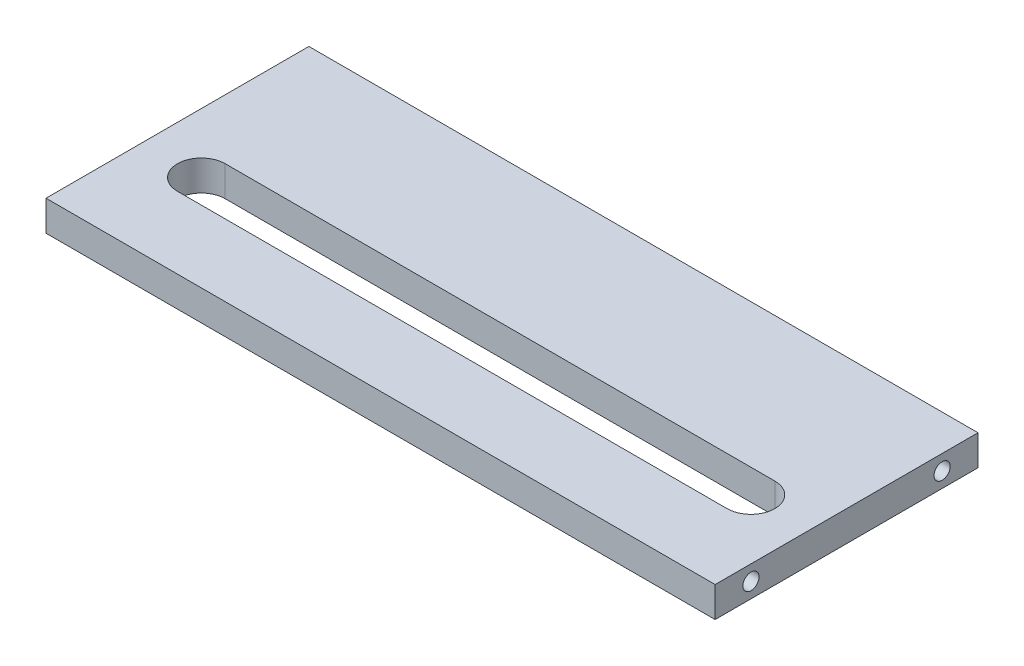
ISO-10303-21;
HEADER;
FILE_DESCRIPTION(('STEP AP214'),'2;1');
FILE_NAME('part.step','',(''),(''),'','','');
FILE_SCHEMA(('AUTOMOTIVE_DESIGN { 1 0 10303 214 1 1 1 1 }'));
ENDSEC;
DATA;
#1=APPLICATION_CONTEXT('core data for automotive mechanical design processes');
#2=APPLICATION_PROTOCOL_DEFINITION('international standard','automotive_design',2000,#1);
#3=PRODUCT_CONTEXT('',#1,'mechanical');
#4=PRODUCT('Part','Part','',(#3));
#5=PRODUCT_RELATED_PRODUCT_CATEGORY('part','',(#4));
#6=PRODUCT_DEFINITION_FORMATION('','',#4);
#7=PRODUCT_DEFINITION_CONTEXT('part definition',#1,'design');
#8=PRODUCT_DEFINITION('design','',#6,#7);
#9=PRODUCT_DEFINITION_SHAPE('','',#8);
#10=(LENGTH_UNIT() NAMED_UNIT(*) SI_UNIT(.MILLI.,.METRE.));
#11=(NAMED_UNIT(*) PLANE_ANGLE_UNIT() SI_UNIT($,.RADIAN.));
#12=(NAMED_UNIT(*) SI_UNIT($,.STERADIAN.) SOLID_ANGLE_UNIT());
#13=UNCERTAINTY_MEASURE_WITH_UNIT(LENGTH_MEASURE(1.E-05),#10,'distance_accuracy_value','');
#14=(GEOMETRIC_REPRESENTATION_CONTEXT(3) GLOBAL_UNCERTAINTY_ASSIGNED_CONTEXT((#13)) GLOBAL_UNIT_ASSIGNED_CONTEXT((#10,
#11,#12)) REPRESENTATION_CONTEXT('',''));
#15=CARTESIAN_POINT('',(0.,0.,0.));
#16=DIRECTION('',(0.,0.,1.));
#17=DIRECTION('',(1.,0.,0.));
#18=AXIS2_PLACEMENT_3D('',#15,#16,#17);
#19=CARTESIAN_POINT('',(0.,12.7,0.));
#20=DIRECTION('',(0.,1.,0.));
#21=DIRECTION('',(0.,0.,1.));
#22=AXIS2_PLACEMENT_3D('',#19,#20,#21);
#23=PLANE('',#22);
#24=DIRECTION('',(0.,0.,1.));
#25=VECTOR('',#24,1.);
#26=CARTESIAN_POINT('',(-125.705705705706,12.7,-56.7567567567568));
#27=LINE('',#26,#25);
#28=CARTESIAN_POINT('',(-125.705705705706,12.7,-56.7567567567568));
#29=VERTEX_POINT('',#28);
#30=CARTESIAN_POINT('',(-125.705705705706,12.7,53.2432432432432));
#31=VERTEX_POINT('',#30);
#32=EDGE_CURVE('E141',#29,#31,#27,.T.);
#33=ORIENTED_EDGE('',*,*,#32,.T.);
#34=DIRECTION('',(1.,0.,0.));
#35=VECTOR('',#34,1.);
#36=CARTESIAN_POINT('',(-125.705705705706,12.7,53.2432432432432));
#37=LINE('',#36,#35);
#38=CARTESIAN_POINT('',(154.294294294294,12.7,53.2432432432432));
#39=VERTEX_POINT('',#38);
#40=EDGE_CURVE('E144',#31,#39,#37,.T.);
#41=ORIENTED_EDGE('',*,*,#40,.T.);
#42=DIRECTION('',(0.,0.,-1.));
#43=VECTOR('',#42,1.);
#44=CARTESIAN_POINT('',(154.294294294294,12.7,-56.7567567567568));
#45=LINE('',#44,#43);
#46=CARTESIAN_POINT('',(154.294294294294,12.7,-56.7567567567568));
#47=VERTEX_POINT('',#46);
#48=EDGE_CURVE('E147',#39,#47,#45,.T.);
#49=ORIENTED_EDGE('',*,*,#48,.T.);
#50=DIRECTION('',(-1.,0.,0.));
#51=VECTOR('',#50,1.);
#52=CARTESIAN_POINT('',(-125.705705705706,12.7,-56.7567567567568));
#53=LINE('',#52,#51);
#54=EDGE_CURVE('E149',#47,#29,#53,.T.);
#55=ORIENTED_EDGE('',*,*,#54,.T.);
#56=EDGE_LOOP('',(#33,#41,#49,#55));
#57=FACE_BOUND('',#56,.T.);
#58=DIRECTION('',(-1.,0.,0.));
#59=VECTOR('',#58,1.);
#60=CARTESIAN_POINT('',(0.,12.7,23.2432432432432));
#61=LINE('',#60,#59);
#62=CARTESIAN_POINT('',(129.294294294294,12.7,23.2432432432432));
#63=VERTEX_POINT('',#62);
#64=CARTESIAN_POINT('',(-100.705705705706,12.7,23.2432432432432));
#65=VERTEX_POINT('',#64);
#66=EDGE_CURVE('E137',#63,#65,#61,.T.);
#67=ORIENTED_EDGE('',*,*,#66,.T.);
#68=CARTESIAN_POINT('',(-100.705705705706,12.7,13.2432432432432));
#69=DIRECTION('',(0.,1.,0.));
#70=DIRECTION('',(0.,0.,1.));
#71=AXIS2_PLACEMENT_3D('',#68,#69,#70);
#72=CIRCLE('',#71,10.);
#73=CARTESIAN_POINT('',(-100.705705705706,12.7,3.24324324324324));
#74=VERTEX_POINT('',#73);
#75=EDGE_CURVE('E101',#65,#74,#72,.F.);
#76=ORIENTED_EDGE('',*,*,#75,.T.);
#77=DIRECTION('',(1.,0.,0.));
#78=VECTOR('',#77,1.);
#79=CARTESIAN_POINT('',(0.,12.7,3.24324324324324));
#80=LINE('',#79,#78);
#81=CARTESIAN_POINT('',(129.294294294294,12.7,3.24324324324324));
#82=VERTEX_POINT('',#81);
#83=EDGE_CURVE('E104',#74,#82,#80,.T.);
#84=ORIENTED_EDGE('',*,*,#83,.T.);
#85=CARTESIAN_POINT('',(129.294294294294,12.7,13.2432432432432));
#86=DIRECTION('',(0.,1.,0.));
#87=DIRECTION('',(0.,0.,1.));
#88=AXIS2_PLACEMENT_3D('',#85,#86,#87);
#89=CIRCLE('',#88,10.);
#90=EDGE_CURVE('E134',#82,#63,#89,.F.);
#91=ORIENTED_EDGE('',*,*,#90,.T.);
#92=EDGE_LOOP('',(#67,#76,#84,#91));
#93=FACE_BOUND('',#92,.T.);
#94=ADVANCED_FACE('F33',(#57,#93),#23,.T.);
#95=CARTESIAN_POINT('',(0.,0.,0.));
#96=DIRECTION('',(0.,1.,0.));
#97=DIRECTION('',(0.,0.,1.));
#98=AXIS2_PLACEMENT_3D('',#95,#96,#97);
#99=PLANE('',#98);
#100=DIRECTION('',(0.,0.,1.));
#101=VECTOR('',#100,1.);
#102=CARTESIAN_POINT('',(-125.705705705706,0.,-56.7567567567568));
#103=LINE('',#102,#101);
#104=CARTESIAN_POINT('',(-125.705705705706,0.,-56.7567567567568));
#105=VERTEX_POINT('',#104);
#106=CARTESIAN_POINT('',(-125.705705705706,0.,53.2432432432432));
#107=VERTEX_POINT('',#106);
#108=EDGE_CURVE('E140',#105,#107,#103,.T.);
#109=ORIENTED_EDGE('',*,*,#108,.F.);
#110=DIRECTION('',(-1.,0.,0.));
#111=VECTOR('',#110,1.);
#112=CARTESIAN_POINT('',(-125.705705705706,0.,-56.7567567567568));
#113=LINE('',#112,#111);
#114=CARTESIAN_POINT('',(154.294294294294,0.,-56.7567567567568));
#115=VERTEX_POINT('',#114);
#116=EDGE_CURVE('E145',#115,#105,#113,.T.);
#117=ORIENTED_EDGE('',*,*,#116,.F.);
#118=DIRECTION('',(0.,0.,-1.));
#119=VECTOR('',#118,1.);
#120=CARTESIAN_POINT('',(154.294294294294,0.,-56.7567567567568));
#121=LINE('',#120,#119);
#122=CARTESIAN_POINT('',(154.294294294294,0.,53.2432432432432));
#123=VERTEX_POINT('',#122);
#124=EDGE_CURVE('E156',#123,#115,#121,.T.);
#125=ORIENTED_EDGE('',*,*,#124,.F.);
#126=DIRECTION('',(1.,0.,0.));
#127=VECTOR('',#126,1.);
#128=CARTESIAN_POINT('',(-125.705705705706,0.,53.2432432432432));
#129=LINE('',#128,#127);
#130=EDGE_CURVE('E154',#107,#123,#129,.T.);
#131=ORIENTED_EDGE('',*,*,#130,.F.);
#132=EDGE_LOOP('',(#109,#117,#125,#131));
#133=FACE_BOUND('',#132,.T.);
#134=CARTESIAN_POINT('',(-100.705705705706,0.,13.2432432432432));
#135=DIRECTION('',(0.,1.,0.));
#136=DIRECTION('',(0.,0.,1.));
#137=AXIS2_PLACEMENT_3D('',#134,#135,#136);
#138=CIRCLE('',#137,10.);
#139=CARTESIAN_POINT('',(-100.705705705706,0.,3.24324324324324));
#140=VERTEX_POINT('',#139);
#141=CARTESIAN_POINT('',(-100.705705705706,0.,23.2432432432432));
#142=VERTEX_POINT('',#141);
#143=EDGE_CURVE('E56',#140,#142,#138,.T.);
#144=ORIENTED_EDGE('',*,*,#143,.T.);
#145=DIRECTION('',(1.,0.,0.));
#146=VECTOR('',#145,1.);
#147=CARTESIAN_POINT('',(-100.705705705706,0.,23.2432432432432));
#148=LINE('',#147,#146);
#149=CARTESIAN_POINT('',(129.294294294294,0.,23.2432432432432));
#150=VERTEX_POINT('',#149);
#151=EDGE_CURVE('E108',#142,#150,#148,.T.);
#152=ORIENTED_EDGE('',*,*,#151,.T.);
#153=CARTESIAN_POINT('',(129.294294294294,0.,13.2432432432432));
#154=DIRECTION('',(0.,1.,0.));
#155=DIRECTION('',(0.,0.,1.));
#156=AXIS2_PLACEMENT_3D('',#153,#154,#155);
#157=CIRCLE('',#156,10.);
#158=CARTESIAN_POINT('',(129.294294294294,0.,3.24324324324324));
#159=VERTEX_POINT('',#158);
#160=EDGE_CURVE('E114',#150,#159,#157,.T.);
#161=ORIENTED_EDGE('',*,*,#160,.T.);
#162=DIRECTION('',(-1.,0.,0.));
#163=VECTOR('',#162,1.);
#164=CARTESIAN_POINT('',(-100.705705705706,0.,3.24324324324324));
#165=LINE('',#164,#163);
#166=EDGE_CURVE('E118',#159,#140,#165,.T.);
#167=ORIENTED_EDGE('',*,*,#166,.T.);
#168=EDGE_LOOP('',(#144,#152,#161,#167));
#169=FACE_BOUND('',#168,.T.);
#170=ADVANCED_FACE('F117',(#133,#169),#99,.F.);
#171=CARTESIAN_POINT('',(-125.705705705706,12.7,-56.7567567567568));
#172=DIRECTION('',(1.,0.,0.));
#173=DIRECTION('',(0.,0.,-1.));
#174=AXIS2_PLACEMENT_3D('',#171,#172,#173);
#175=PLANE('',#174);
#176=CARTESIAN_POINT('',(-125.705705705706,6.35,-41.7567567567568));
#177=DIRECTION('',(-1.,0.,0.));
#178=DIRECTION('',(0.,0.,1.));
#179=AXIS2_PLACEMENT_3D('',#176,#177,#178);
#180=CIRCLE('',#179,3.375);
#181=CARTESIAN_POINT('',(-125.705705705706,6.35,-38.3817567567568));
#182=VERTEX_POINT('',#181);
#183=EDGE_CURVE('E264',#182,#182,#180,.T.);
#184=ORIENTED_EDGE('',*,*,#183,.F.);
#185=EDGE_LOOP('',(#184));
#186=FACE_BOUND('',#185,.T.);
#187=CARTESIAN_POINT('',(-125.705705705706,6.35,38.2432432432432));
#188=DIRECTION('',(-1.,0.,0.));
#189=DIRECTION('',(0.,0.,1.));
#190=AXIS2_PLACEMENT_3D('',#187,#188,#189);
#191=CIRCLE('',#190,3.375);
#192=CARTESIAN_POINT('',(-125.705705705706,6.35,41.6182432432432));
#193=VERTEX_POINT('',#192);
#194=EDGE_CURVE('E122',#193,#193,#191,.T.);
#195=ORIENTED_EDGE('',*,*,#194,.F.);
#196=EDGE_LOOP('',(#195));
#197=FACE_BOUND('',#196,.T.);
#198=ORIENTED_EDGE('',*,*,#108,.T.);
#199=DIRECTION('',(0.,-1.,0.));
#200=VECTOR('',#199,1.);
#201=CARTESIAN_POINT('',(-125.705705705706,12.7,53.2432432432432));
#202=LINE('',#201,#200);
#203=EDGE_CURVE('E11',#31,#107,#202,.T.);
#204=ORIENTED_EDGE('',*,*,#203,.F.);
#205=ORIENTED_EDGE('',*,*,#32,.F.);
#206=DIRECTION('',(0.,-1.,0.));
#207=VECTOR('',#206,1.);
#208=CARTESIAN_POINT('',(-125.705705705706,12.7,-56.7567567567568));
#209=LINE('',#208,#207);
#210=EDGE_CURVE('E151',#29,#105,#209,.T.);
#211=ORIENTED_EDGE('',*,*,#210,.T.);
#212=EDGE_LOOP('',(#198,#204,#205,#211));
#213=FACE_BOUND('',#212,.T.);
#214=ADVANCED_FACE('F35',(#186,#197,#213),#175,.F.);
#215=CARTESIAN_POINT('',(-125.705705705706,12.7,53.2432432432432));
#216=DIRECTION('',(0.,0.,-1.));
#217=DIRECTION('',(-1.,0.,0.));
#218=AXIS2_PLACEMENT_3D('',#215,#216,#217);
#219=PLANE('',#218);
#220=ORIENTED_EDGE('',*,*,#130,.T.);
#221=DIRECTION('',(0.,-1.,0.));
#222=VECTOR('',#221,1.);
#223=CARTESIAN_POINT('',(154.294294294294,12.7,53.2432432432432));
#224=LINE('',#223,#222);
#225=EDGE_CURVE('E41',#39,#123,#224,.T.);
#226=ORIENTED_EDGE('',*,*,#225,.F.);
#227=ORIENTED_EDGE('',*,*,#40,.F.);
#228=ORIENTED_EDGE('',*,*,#203,.T.);
#229=EDGE_LOOP('',(#220,#226,#227,#228));
#230=FACE_BOUND('',#229,.T.);
#231=ADVANCED_FACE('F183',(#230),#219,.F.);
#232=CARTESIAN_POINT('',(154.294294294294,12.7,-56.7567567567568));
#233=DIRECTION('',(-1.,0.,0.));
#234=DIRECTION('',(0.,0.,1.));
#235=AXIS2_PLACEMENT_3D('',#232,#233,#234);
#236=PLANE('',#235);
#237=CARTESIAN_POINT('',(154.294294294294,6.35,38.2432432432432));
#238=DIRECTION('',(1.,0.,0.));
#239=DIRECTION('',(0.,0.,-1.));
#240=AXIS2_PLACEMENT_3D('',#237,#238,#239);
#241=CIRCLE('',#240,3.375);
#242=CARTESIAN_POINT('',(154.294294294294,6.35,34.8682432432432));
#243=VERTEX_POINT('',#242);
#244=EDGE_CURVE('E255',#243,#243,#241,.T.);
#245=ORIENTED_EDGE('',*,*,#244,.F.);
#246=EDGE_LOOP('',(#245));
#247=FACE_BOUND('',#246,.T.);
#248=CARTESIAN_POINT('',(154.294294294294,6.35,-41.7567567567568));
#249=DIRECTION('',(1.,0.,0.));
#250=DIRECTION('',(0.,0.,-1.));
#251=AXIS2_PLACEMENT_3D('',#248,#249,#250);
#252=CIRCLE('',#251,3.375);
#253=CARTESIAN_POINT('',(154.294294294294,6.35,-45.1317567567568));
#254=VERTEX_POINT('',#253);
#255=EDGE_CURVE('E254',#254,#254,#252,.T.);
#256=ORIENTED_EDGE('',*,*,#255,.F.);
#257=EDGE_LOOP('',(#256));
#258=FACE_BOUND('',#257,.T.);
#259=ORIENTED_EDGE('',*,*,#124,.T.);
#260=DIRECTION('',(0.,-1.,0.));
#261=VECTOR('',#260,1.);
#262=CARTESIAN_POINT('',(154.294294294294,12.7,-56.7567567567568));
#263=LINE('',#262,#261);
#264=EDGE_CURVE('E161',#47,#115,#263,.T.);
#265=ORIENTED_EDGE('',*,*,#264,.F.);
#266=ORIENTED_EDGE('',*,*,#48,.F.);
#267=ORIENTED_EDGE('',*,*,#225,.T.);
#268=EDGE_LOOP('',(#259,#265,#266,#267));
#269=FACE_BOUND('',#268,.T.);
#270=ADVANCED_FACE('F168',(#247,#258,#269),#236,.F.);
#271=CARTESIAN_POINT('',(-125.705705705706,12.7,-56.7567567567568));
#272=DIRECTION('',(0.,0.,1.));
#273=DIRECTION('',(1.,0.,0.));
#274=AXIS2_PLACEMENT_3D('',#271,#272,#273);
#275=PLANE('',#274);
#276=ORIENTED_EDGE('',*,*,#116,.T.);
#277=ORIENTED_EDGE('',*,*,#210,.F.);
#278=ORIENTED_EDGE('',*,*,#54,.F.);
#279=ORIENTED_EDGE('',*,*,#264,.T.);
#280=EDGE_LOOP('',(#276,#277,#278,#279));
#281=FACE_BOUND('',#280,.T.);
#282=ADVANCED_FACE('F176',(#281),#275,.F.);
#283=CARTESIAN_POINT('',(-100.705705705706,20.,13.2432432432432));
#284=DIRECTION('',(0.,-1.,0.));
#285=DIRECTION('',(0.,0.,-1.));
#286=AXIS2_PLACEMENT_3D('',#283,#284,#285);
#287=CYLINDRICAL_SURFACE('',#286,10.);
#288=DIRECTION('',(0.,-1.,0.));
#289=VECTOR('',#288,1.);
#290=CARTESIAN_POINT('',(-100.705705705706,20.,23.2432432432432));
#291=LINE('',#290,#289);
#292=EDGE_CURVE('E97',#65,#142,#291,.T.);
#293=ORIENTED_EDGE('',*,*,#292,.T.);
#294=ORIENTED_EDGE('',*,*,#143,.F.);
#295=DIRECTION('',(0.,-1.,0.));
#296=VECTOR('',#295,1.);
#297=CARTESIAN_POINT('',(-100.705705705706,20.,3.24324324324324));
#298=LINE('',#297,#296);
#299=EDGE_CURVE('E128',#74,#140,#298,.T.);
#300=ORIENTED_EDGE('',*,*,#299,.F.);
#301=ORIENTED_EDGE('',*,*,#75,.F.);
#302=EDGE_LOOP('',(#293,#294,#300,#301));
#303=FACE_BOUND('',#302,.T.);
#304=ADVANCED_FACE('F99',(#303),#287,.F.);
#305=CARTESIAN_POINT('',(-100.705705705706,20.,23.2432432432432));
#306=DIRECTION('',(0.,0.,-1.));
#307=DIRECTION('',(-1.,0.,0.));
#308=AXIS2_PLACEMENT_3D('',#305,#306,#307);
#309=PLANE('',#308);
#310=DIRECTION('',(0.,-1.,0.));
#311=VECTOR('',#310,1.);
#312=CARTESIAN_POINT('',(129.294294294294,20.,23.2432432432432));
#313=LINE('',#312,#311);
#314=EDGE_CURVE('E105',#63,#150,#313,.T.);
#315=ORIENTED_EDGE('',*,*,#314,.T.);
#316=ORIENTED_EDGE('',*,*,#151,.F.);
#317=ORIENTED_EDGE('',*,*,#292,.F.);
#318=ORIENTED_EDGE('',*,*,#66,.F.);
#319=EDGE_LOOP('',(#315,#316,#317,#318));
#320=FACE_BOUND('',#319,.T.);
#321=ADVANCED_FACE('F109',(#320),#309,.T.);
#322=CARTESIAN_POINT('',(129.294294294294,20.,13.2432432432432));
#323=DIRECTION('',(0.,-1.,0.));
#324=DIRECTION('',(0.,0.,-1.));
#325=AXIS2_PLACEMENT_3D('',#322,#323,#324);
#326=CYLINDRICAL_SURFACE('',#325,10.);
#327=DIRECTION('',(0.,-1.,0.));
#328=VECTOR('',#327,1.);
#329=CARTESIAN_POINT('',(129.294294294294,20.,3.24324324324324));
#330=LINE('',#329,#328);
#331=EDGE_CURVE('E48',#82,#159,#330,.T.);
#332=ORIENTED_EDGE('',*,*,#331,.T.);
#333=ORIENTED_EDGE('',*,*,#160,.F.);
#334=ORIENTED_EDGE('',*,*,#314,.F.);
#335=ORIENTED_EDGE('',*,*,#90,.F.);
#336=EDGE_LOOP('',(#332,#333,#334,#335));
#337=FACE_BOUND('',#336,.T.);
#338=ADVANCED_FACE('F208',(#337),#326,.F.);
#339=CARTESIAN_POINT('',(-100.705705705706,20.,3.24324324324324));
#340=DIRECTION('',(0.,0.,1.));
#341=DIRECTION('',(1.,0.,0.));
#342=AXIS2_PLACEMENT_3D('',#339,#340,#341);
#343=PLANE('',#342);
#344=ORIENTED_EDGE('',*,*,#299,.T.);
#345=ORIENTED_EDGE('',*,*,#166,.F.);
#346=ORIENTED_EDGE('',*,*,#331,.F.);
#347=ORIENTED_EDGE('',*,*,#83,.F.);
#348=EDGE_LOOP('',(#344,#345,#346,#347));
#349=FACE_BOUND('',#348,.T.);
#350=ADVANCED_FACE('F212',(#349),#343,.T.);
#351=CARTESIAN_POINT('',(-95.7057057057057,6.35,38.2432432432432));
#352=DIRECTION('',(-1.,0.,0.));
#353=DIRECTION('',(0.,0.,1.));
#354=AXIS2_PLACEMENT_3D('',#351,#352,#353);
#355=CYLINDRICAL_SURFACE('',#354,3.375);
#356=CARTESIAN_POINT('',(-95.7057057057057,6.35,38.2432432432432));
#357=DIRECTION('',(-1.,0.,0.));
#358=DIRECTION('',(0.,0.,1.));
#359=AXIS2_PLACEMENT_3D('',#356,#357,#358);
#360=CIRCLE('',#359,3.375);
#361=CARTESIAN_POINT('',(-95.7057057057057,6.35,41.6182432432432));
#362=VERTEX_POINT('',#361);
#363=EDGE_CURVE('E119',#362,#362,#360,.T.);
#364=ORIENTED_EDGE('',*,*,#363,.F.);
#365=EDGE_LOOP('',(#364));
#366=FACE_BOUND('',#365,.T.);
#367=ORIENTED_EDGE('',*,*,#194,.T.);
#368=EDGE_LOOP('',(#367));
#369=FACE_BOUND('',#368,.T.);
#370=ADVANCED_FACE('F218',(#366,#369),#355,.F.);
#371=CARTESIAN_POINT('',(-95.7057057057057,6.35,38.2432432432432));
#372=DIRECTION('',(-1.,0.,0.));
#373=DIRECTION('',(0.,0.,1.));
#374=AXIS2_PLACEMENT_3D('',#371,#372,#373);
#375=PLANE('',#374);
#376=ORIENTED_EDGE('',*,*,#363,.T.);
#377=EDGE_LOOP('',(#376));
#378=FACE_BOUND('',#377,.T.);
#379=ADVANCED_FACE('F221',(#378),#375,.T.);
#380=CARTESIAN_POINT('',(-95.7057057057057,6.35,-41.7567567567568));
#381=DIRECTION('',(-1.,0.,0.));
#382=DIRECTION('',(0.,0.,1.));
#383=AXIS2_PLACEMENT_3D('',#380,#381,#382);
#384=CYLINDRICAL_SURFACE('',#383,3.375);
#385=CARTESIAN_POINT('',(-95.7057057057057,6.35,-41.7567567567568));
#386=DIRECTION('',(-1.,0.,0.));
#387=DIRECTION('',(0.,0.,1.));
#388=AXIS2_PLACEMENT_3D('',#385,#386,#387);
#389=CIRCLE('',#388,3.375);
#390=CARTESIAN_POINT('',(-95.7057057057057,6.35,-38.3817567567568));
#391=VERTEX_POINT('',#390);
#392=EDGE_CURVE('E266',#391,#391,#389,.T.);
#393=ORIENTED_EDGE('',*,*,#392,.F.);
#394=EDGE_LOOP('',(#393));
#395=FACE_BOUND('',#394,.T.);
#396=ORIENTED_EDGE('',*,*,#183,.T.);
#397=EDGE_LOOP('',(#396));
#398=FACE_BOUND('',#397,.T.);
#399=ADVANCED_FACE('F225',(#395,#398),#384,.F.);
#400=CARTESIAN_POINT('',(-95.7057057057057,6.35,-41.7567567567568));
#401=DIRECTION('',(-1.,0.,0.));
#402=DIRECTION('',(0.,0.,1.));
#403=AXIS2_PLACEMENT_3D('',#400,#401,#402);
#404=PLANE('',#403);
#405=ORIENTED_EDGE('',*,*,#392,.T.);
#406=EDGE_LOOP('',(#405));
#407=FACE_BOUND('',#406,.T.);
#408=ADVANCED_FACE('F229',(#407),#404,.T.);
#409=CARTESIAN_POINT('',(124.294294294294,6.35,-41.7567567567568));
#410=DIRECTION('',(1.,0.,0.));
#411=DIRECTION('',(0.,0.,-1.));
#412=AXIS2_PLACEMENT_3D('',#409,#410,#411);
#413=CYLINDRICAL_SURFACE('',#412,3.375);
#414=CARTESIAN_POINT('',(124.294294294294,6.35,-41.7567567567568));
#415=DIRECTION('',(1.,0.,0.));
#416=DIRECTION('',(0.,0.,-1.));
#417=AXIS2_PLACEMENT_3D('',#414,#415,#416);
#418=CIRCLE('',#417,3.375);
#419=CARTESIAN_POINT('',(124.294294294294,6.35,-45.1317567567568));
#420=VERTEX_POINT('',#419);
#421=EDGE_CURVE('E258',#420,#420,#418,.T.);
#422=ORIENTED_EDGE('',*,*,#421,.F.);
#423=EDGE_LOOP('',(#422));
#424=FACE_BOUND('',#423,.T.);
#425=ORIENTED_EDGE('',*,*,#255,.T.);
#426=EDGE_LOOP('',(#425));
#427=FACE_BOUND('',#426,.T.);
#428=ADVANCED_FACE('F233',(#424,#427),#413,.F.);
#429=CARTESIAN_POINT('',(124.294294294294,6.35,-41.7567567567568));
#430=DIRECTION('',(1.,0.,0.));
#431=DIRECTION('',(0.,0.,-1.));
#432=AXIS2_PLACEMENT_3D('',#429,#430,#431);
#433=PLANE('',#432);
#434=ORIENTED_EDGE('',*,*,#421,.T.);
#435=EDGE_LOOP('',(#434));
#436=FACE_BOUND('',#435,.T.);
#437=ADVANCED_FACE('F237',(#436),#433,.T.);
#438=CARTESIAN_POINT('',(124.294294294294,6.35,38.2432432432432));
#439=DIRECTION('',(1.,0.,0.));
#440=DIRECTION('',(0.,0.,-1.));
#441=AXIS2_PLACEMENT_3D('',#438,#439,#440);
#442=CYLINDRICAL_SURFACE('',#441,3.375);
#443=CARTESIAN_POINT('',(124.294294294294,6.35,38.2432432432432));
#444=DIRECTION('',(1.,0.,0.));
#445=DIRECTION('',(0.,0.,-1.));
#446=AXIS2_PLACEMENT_3D('',#443,#444,#445);
#447=CIRCLE('',#446,3.375);
#448=CARTESIAN_POINT('',(124.294294294294,6.35,34.8682432432432));
#449=VERTEX_POINT('',#448);
#450=EDGE_CURVE('E253',#449,#449,#447,.T.);
#451=ORIENTED_EDGE('',*,*,#450,.F.);
#452=EDGE_LOOP('',(#451));
#453=FACE_BOUND('',#452,.T.);
#454=ORIENTED_EDGE('',*,*,#244,.T.);
#455=EDGE_LOOP('',(#454));
#456=FACE_BOUND('',#455,.T.);
#457=ADVANCED_FACE('F241',(#453,#456),#442,.F.);
#458=CARTESIAN_POINT('',(124.294294294294,6.35,38.2432432432432));
#459=DIRECTION('',(1.,0.,0.));
#460=DIRECTION('',(0.,0.,-1.));
#461=AXIS2_PLACEMENT_3D('',#458,#459,#460);
#462=PLANE('',#461);
#463=ORIENTED_EDGE('',*,*,#450,.T.);
#464=EDGE_LOOP('',(#463));
#465=FACE_BOUND('',#464,.T.);
#466=ADVANCED_FACE('F245',(#465),#462,.T.);
#467=CLOSED_SHELL('',(#94,#170,#214,#231,#270,#282,#304,#321,#338,#350,#370,#379,#399,#408,#428,
#437,#457,#466));
#468=MANIFOLD_SOLID_BREP('B2',#467);
#469=ADVANCED_BREP_SHAPE_REPRESENTATION('',(#18,#468),#14);
#470=SHAPE_DEFINITION_REPRESENTATION(#9,#469);
ENDSEC;
END-ISO-10303-21;
